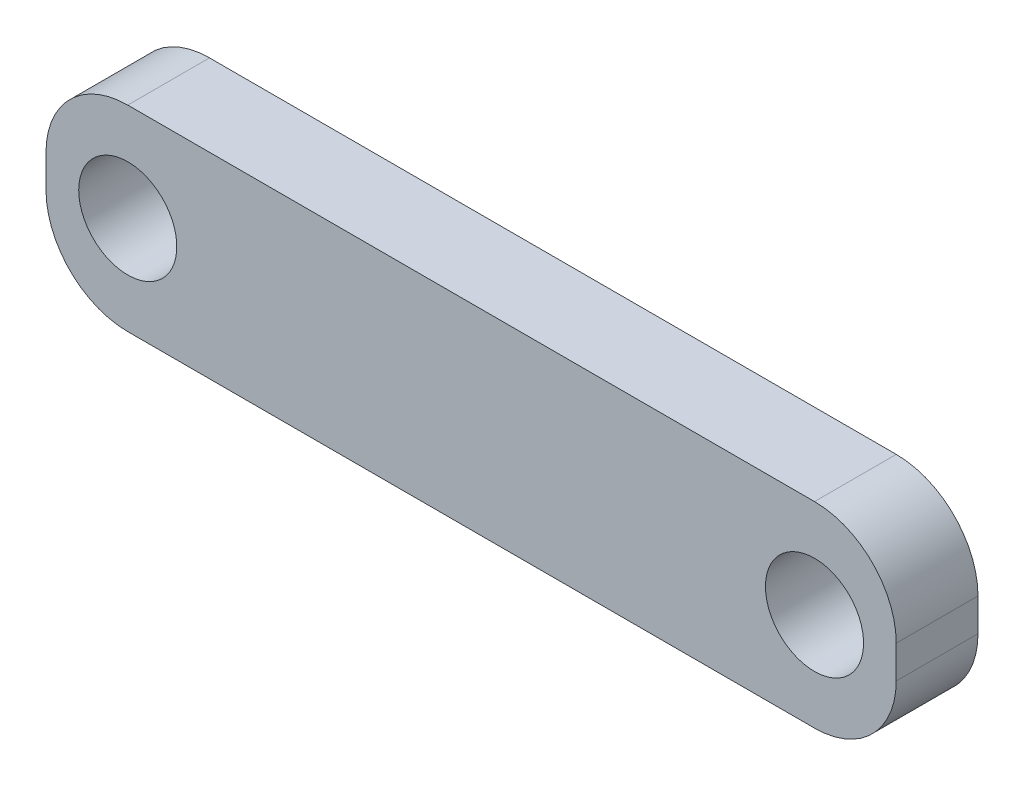
ISO-10303-21;
HEADER;
FILE_DESCRIPTION(('STEP AP214'),'2;1');
FILE_NAME('part.step','',(''),(''),'','','');
FILE_SCHEMA(('AUTOMOTIVE_DESIGN { 1 0 10303 214 1 1 1 1 }'));
ENDSEC;
DATA;
#1=APPLICATION_CONTEXT('core data for automotive mechanical design processes');
#2=APPLICATION_PROTOCOL_DEFINITION('international standard','automotive_design',2000,#1);
#3=PRODUCT_CONTEXT('',#1,'mechanical');
#4=PRODUCT('Part','Part','',(#3));
#5=PRODUCT_RELATED_PRODUCT_CATEGORY('part','',(#4));
#6=PRODUCT_DEFINITION_FORMATION('','',#4);
#7=PRODUCT_DEFINITION_CONTEXT('part definition',#1,'design');
#8=PRODUCT_DEFINITION('design','',#6,#7);
#9=PRODUCT_DEFINITION_SHAPE('','',#8);
#10=(LENGTH_UNIT() NAMED_UNIT(*) SI_UNIT(.MILLI.,.METRE.));
#11=(NAMED_UNIT(*) PLANE_ANGLE_UNIT() SI_UNIT($,.RADIAN.));
#12=(NAMED_UNIT(*) SI_UNIT($,.STERADIAN.) SOLID_ANGLE_UNIT());
#13=UNCERTAINTY_MEASURE_WITH_UNIT(LENGTH_MEASURE(1.E-05),#10,'distance_accuracy_value','');
#14=(GEOMETRIC_REPRESENTATION_CONTEXT(3) GLOBAL_UNCERTAINTY_ASSIGNED_CONTEXT((#13)) GLOBAL_UNIT_ASSIGNED_CONTEXT((#10,
#11,#12)) REPRESENTATION_CONTEXT('',''));
#15=CARTESIAN_POINT('',(0.,0.,0.));
#16=DIRECTION('',(0.,0.,1.));
#17=DIRECTION('',(1.,0.,0.));
#18=AXIS2_PLACEMENT_3D('',#15,#16,#17);
#19=CARTESIAN_POINT('',(-21.,1.,0.));
#20=DIRECTION('',(0.,0.,1.));
#21=DIRECTION('',(1.,0.,0.));
#22=AXIS2_PLACEMENT_3D('',#19,#20,#21);
#23=CYLINDRICAL_SURFACE('',#22,5.);
#24=CARTESIAN_POINT('',(-21.,1.,5.));
#25=DIRECTION('',(0.,0.,1.));
#26=DIRECTION('',(1.,0.,0.));
#27=AXIS2_PLACEMENT_3D('',#24,#25,#26);
#28=CIRCLE('',#27,5.);
#29=CARTESIAN_POINT('',(-21.,6.,5.));
#30=VERTEX_POINT('',#29);
#31=CARTESIAN_POINT('',(-26.,1.,5.));
#32=VERTEX_POINT('',#31);
#33=EDGE_CURVE('E131',#30,#32,#28,.T.);
#34=ORIENTED_EDGE('',*,*,#33,.F.);
#35=DIRECTION('',(0.,0.,1.));
#36=VECTOR('',#35,1.);
#37=CARTESIAN_POINT('',(-21.,6.,0.));
#38=LINE('',#37,#36);
#39=CARTESIAN_POINT('',(-21.,6.,0.));
#40=VERTEX_POINT('',#39);
#41=EDGE_CURVE('E11',#40,#30,#38,.T.);
#42=ORIENTED_EDGE('',*,*,#41,.F.);
#43=CARTESIAN_POINT('',(-21.,1.,0.));
#44=DIRECTION('',(0.,0.,1.));
#45=DIRECTION('',(1.,0.,0.));
#46=AXIS2_PLACEMENT_3D('',#43,#44,#45);
#47=CIRCLE('',#46,5.);
#48=CARTESIAN_POINT('',(-26.,1.,0.));
#49=VERTEX_POINT('',#48);
#50=EDGE_CURVE('E152',#40,#49,#47,.T.);
#51=ORIENTED_EDGE('',*,*,#50,.T.);
#52=DIRECTION('',(0.,0.,1.));
#53=VECTOR('',#52,1.);
#54=CARTESIAN_POINT('',(-26.,1.,0.));
#55=LINE('',#54,#53);
#56=EDGE_CURVE('E37',#49,#32,#55,.T.);
#57=ORIENTED_EDGE('',*,*,#56,.T.);
#58=EDGE_LOOP('',(#34,#42,#51,#57));
#59=FACE_BOUND('',#58,.T.);
#60=ADVANCED_FACE('F34',(#59),#23,.T.);
#61=CARTESIAN_POINT('',(21.,6.00000000000001,0.));
#62=DIRECTION('',(0.,1.,0.));
#63=DIRECTION('',(-1.,0.,0.));
#64=AXIS2_PLACEMENT_3D('',#61,#62,#63);
#65=PLANE('',#64);
#66=DIRECTION('',(-1.,0.,0.));
#67=VECTOR('',#66,1.);
#68=CARTESIAN_POINT('',(21.,6.00000000000001,5.));
#69=LINE('',#68,#67);
#70=CARTESIAN_POINT('',(21.,6.,5.));
#71=VERTEX_POINT('',#70);
#72=EDGE_CURVE('E150',#71,#30,#69,.T.);
#73=ORIENTED_EDGE('',*,*,#72,.F.);
#74=DIRECTION('',(0.,0.,1.));
#75=VECTOR('',#74,1.);
#76=CARTESIAN_POINT('',(21.,6.,0.));
#77=LINE('',#76,#75);
#78=CARTESIAN_POINT('',(21.,6.,0.));
#79=VERTEX_POINT('',#78);
#80=EDGE_CURVE('E43',#79,#71,#77,.T.);
#81=ORIENTED_EDGE('',*,*,#80,.F.);
#82=DIRECTION('',(-1.,0.,0.));
#83=VECTOR('',#82,1.);
#84=CARTESIAN_POINT('',(21.,6.00000000000001,0.));
#85=LINE('',#84,#83);
#86=EDGE_CURVE('E121',#79,#40,#85,.T.);
#87=ORIENTED_EDGE('',*,*,#86,.T.);
#88=ORIENTED_EDGE('',*,*,#41,.T.);
#89=EDGE_LOOP('',(#73,#81,#87,#88));
#90=FACE_BOUND('',#89,.T.);
#91=ADVANCED_FACE('F164',(#90),#65,.T.);
#92=CARTESIAN_POINT('',(21.,1.,0.));
#93=DIRECTION('',(0.,0.,1.));
#94=DIRECTION('',(1.,0.,0.));
#95=AXIS2_PLACEMENT_3D('',#92,#93,#94);
#96=CYLINDRICAL_SURFACE('',#95,5.);
#97=CARTESIAN_POINT('',(21.,1.,5.));
#98=DIRECTION('',(0.,0.,1.));
#99=DIRECTION('',(1.,0.,0.));
#100=AXIS2_PLACEMENT_3D('',#97,#98,#99);
#101=CIRCLE('',#100,5.);
#102=CARTESIAN_POINT('',(26.,1.,5.));
#103=VERTEX_POINT('',#102);
#104=EDGE_CURVE('E108',#103,#71,#101,.T.);
#105=ORIENTED_EDGE('',*,*,#104,.F.);
#106=DIRECTION('',(0.,0.,1.));
#107=VECTOR('',#106,1.);
#108=CARTESIAN_POINT('',(26.,1.,0.));
#109=LINE('',#108,#107);
#110=CARTESIAN_POINT('',(26.,1.,0.));
#111=VERTEX_POINT('',#110);
#112=EDGE_CURVE('E103',#111,#103,#109,.T.);
#113=ORIENTED_EDGE('',*,*,#112,.F.);
#114=CARTESIAN_POINT('',(21.,1.,0.));
#115=DIRECTION('',(0.,0.,1.));
#116=DIRECTION('',(1.,0.,0.));
#117=AXIS2_PLACEMENT_3D('',#114,#115,#116);
#118=CIRCLE('',#117,5.);
#119=EDGE_CURVE('E106',#111,#79,#118,.T.);
#120=ORIENTED_EDGE('',*,*,#119,.T.);
#121=ORIENTED_EDGE('',*,*,#80,.T.);
#122=EDGE_LOOP('',(#105,#113,#120,#121));
#123=FACE_BOUND('',#122,.T.);
#124=ADVANCED_FACE('F105',(#123),#96,.T.);
#125=CARTESIAN_POINT('',(26.,-1.,0.));
#126=DIRECTION('',(1.,0.,0.));
#127=DIRECTION('',(0.,0.,-1.));
#128=AXIS2_PLACEMENT_3D('',#125,#126,#127);
#129=PLANE('',#128);
#130=DIRECTION('',(0.,1.,0.));
#131=VECTOR('',#130,1.);
#132=CARTESIAN_POINT('',(26.,-1.,5.));
#133=LINE('',#132,#131);
#134=CARTESIAN_POINT('',(26.,-1.,5.));
#135=VERTEX_POINT('',#134);
#136=EDGE_CURVE('E147',#135,#103,#133,.T.);
#137=ORIENTED_EDGE('',*,*,#136,.F.);
#138=DIRECTION('',(0.,0.,1.));
#139=VECTOR('',#138,1.);
#140=CARTESIAN_POINT('',(26.,-1.,0.));
#141=LINE('',#140,#139);
#142=CARTESIAN_POINT('',(26.,-1.,0.));
#143=VERTEX_POINT('',#142);
#144=EDGE_CURVE('E113',#143,#135,#141,.T.);
#145=ORIENTED_EDGE('',*,*,#144,.F.);
#146=DIRECTION('',(0.,1.,0.));
#147=VECTOR('',#146,1.);
#148=CARTESIAN_POINT('',(26.,-1.,0.));
#149=LINE('',#148,#147);
#150=EDGE_CURVE('E119',#143,#111,#149,.T.);
#151=ORIENTED_EDGE('',*,*,#150,.T.);
#152=ORIENTED_EDGE('',*,*,#112,.T.);
#153=EDGE_LOOP('',(#137,#145,#151,#152));
#154=FACE_BOUND('',#153,.T.);
#155=ADVANCED_FACE('F123',(#154),#129,.T.);
#156=CARTESIAN_POINT('',(21.,-1.,0.));
#157=DIRECTION('',(0.,0.,1.));
#158=DIRECTION('',(1.,0.,0.));
#159=AXIS2_PLACEMENT_3D('',#156,#157,#158);
#160=CYLINDRICAL_SURFACE('',#159,5.);
#161=CARTESIAN_POINT('',(21.,-1.,5.));
#162=DIRECTION('',(0.,0.,1.));
#163=DIRECTION('',(1.,0.,0.));
#164=AXIS2_PLACEMENT_3D('',#161,#162,#163);
#165=CIRCLE('',#164,5.);
#166=CARTESIAN_POINT('',(21.,-6.,5.));
#167=VERTEX_POINT('',#166);
#168=EDGE_CURVE('E144',#167,#135,#165,.T.);
#169=ORIENTED_EDGE('',*,*,#168,.F.);
#170=DIRECTION('',(0.,0.,1.));
#171=VECTOR('',#170,1.);
#172=CARTESIAN_POINT('',(21.,-6.,0.));
#173=LINE('',#172,#171);
#174=CARTESIAN_POINT('',(21.,-6.,0.));
#175=VERTEX_POINT('',#174);
#176=EDGE_CURVE('E156',#175,#167,#173,.T.);
#177=ORIENTED_EDGE('',*,*,#176,.F.);
#178=CARTESIAN_POINT('',(21.,-1.,0.));
#179=DIRECTION('',(0.,0.,1.));
#180=DIRECTION('',(1.,0.,0.));
#181=AXIS2_PLACEMENT_3D('',#178,#179,#180);
#182=CIRCLE('',#181,5.);
#183=EDGE_CURVE('E124',#175,#143,#182,.T.);
#184=ORIENTED_EDGE('',*,*,#183,.T.);
#185=ORIENTED_EDGE('',*,*,#144,.T.);
#186=EDGE_LOOP('',(#169,#177,#184,#185));
#187=FACE_BOUND('',#186,.T.);
#188=ADVANCED_FACE('F177',(#187),#160,.T.);
#189=CARTESIAN_POINT('',(-21.,-6.,0.));
#190=DIRECTION('',(0.,-1.,0.));
#191=DIRECTION('',(1.,0.,0.));
#192=AXIS2_PLACEMENT_3D('',#189,#190,#191);
#193=PLANE('',#192);
#194=DIRECTION('',(1.,0.,0.));
#195=VECTOR('',#194,1.);
#196=CARTESIAN_POINT('',(-21.,-6.,5.));
#197=LINE('',#196,#195);
#198=CARTESIAN_POINT('',(-21.,-6.,5.));
#199=VERTEX_POINT('',#198);
#200=EDGE_CURVE('E141',#199,#167,#197,.T.);
#201=ORIENTED_EDGE('',*,*,#200,.F.);
#202=DIRECTION('',(0.,0.,1.));
#203=VECTOR('',#202,1.);
#204=CARTESIAN_POINT('',(-21.,-6.,0.));
#205=LINE('',#204,#203);
#206=CARTESIAN_POINT('',(-21.,-6.,0.));
#207=VERTEX_POINT('',#206);
#208=EDGE_CURVE('E158',#207,#199,#205,.T.);
#209=ORIENTED_EDGE('',*,*,#208,.F.);
#210=DIRECTION('',(1.,0.,0.));
#211=VECTOR('',#210,1.);
#212=CARTESIAN_POINT('',(-21.,-6.,0.));
#213=LINE('',#212,#211);
#214=EDGE_CURVE('E126',#207,#175,#213,.T.);
#215=ORIENTED_EDGE('',*,*,#214,.T.);
#216=ORIENTED_EDGE('',*,*,#176,.T.);
#217=EDGE_LOOP('',(#201,#209,#215,#216));
#218=FACE_BOUND('',#217,.T.);
#219=ADVANCED_FACE('F180',(#218),#193,.T.);
#220=CARTESIAN_POINT('',(-21.,-1.,0.));
#221=DIRECTION('',(0.,0.,1.));
#222=DIRECTION('',(1.,0.,0.));
#223=AXIS2_PLACEMENT_3D('',#220,#221,#222);
#224=CYLINDRICAL_SURFACE('',#223,5.);
#225=CARTESIAN_POINT('',(-21.,-1.,5.));
#226=DIRECTION('',(0.,0.,1.));
#227=DIRECTION('',(1.,0.,0.));
#228=AXIS2_PLACEMENT_3D('',#225,#226,#227);
#229=CIRCLE('',#228,5.);
#230=CARTESIAN_POINT('',(-26.,-1.,5.));
#231=VERTEX_POINT('',#230);
#232=EDGE_CURVE('E138',#231,#199,#229,.T.);
#233=ORIENTED_EDGE('',*,*,#232,.F.);
#234=DIRECTION('',(0.,0.,1.));
#235=VECTOR('',#234,1.);
#236=CARTESIAN_POINT('',(-26.,-1.,0.));
#237=LINE('',#236,#235);
#238=CARTESIAN_POINT('',(-26.,-1.,0.));
#239=VERTEX_POINT('',#238);
#240=EDGE_CURVE('E159',#239,#231,#237,.T.);
#241=ORIENTED_EDGE('',*,*,#240,.F.);
#242=CARTESIAN_POINT('',(-21.,-1.,0.));
#243=DIRECTION('',(0.,0.,1.));
#244=DIRECTION('',(1.,0.,0.));
#245=AXIS2_PLACEMENT_3D('',#242,#243,#244);
#246=CIRCLE('',#245,5.);
#247=EDGE_CURVE('E226',#239,#207,#246,.T.);
#248=ORIENTED_EDGE('',*,*,#247,.T.);
#249=ORIENTED_EDGE('',*,*,#208,.T.);
#250=EDGE_LOOP('',(#233,#241,#248,#249));
#251=FACE_BOUND('',#250,.T.);
#252=ADVANCED_FACE('F184',(#251),#224,.T.);
#253=CARTESIAN_POINT('',(-26.,1.,0.));
#254=DIRECTION('',(-1.,0.,0.));
#255=DIRECTION('',(0.,0.,1.));
#256=AXIS2_PLACEMENT_3D('',#253,#254,#255);
#257=PLANE('',#256);
#258=DIRECTION('',(0.,-1.,0.));
#259=VECTOR('',#258,1.);
#260=CARTESIAN_POINT('',(-26.,1.,5.));
#261=LINE('',#260,#259);
#262=EDGE_CURVE('E134',#32,#231,#261,.T.);
#263=ORIENTED_EDGE('',*,*,#262,.F.);
#264=ORIENTED_EDGE('',*,*,#56,.F.);
#265=DIRECTION('',(0.,-1.,0.));
#266=VECTOR('',#265,1.);
#267=CARTESIAN_POINT('',(-26.,1.,0.));
#268=LINE('',#267,#266);
#269=EDGE_CURVE('E224',#49,#239,#268,.T.);
#270=ORIENTED_EDGE('',*,*,#269,.T.);
#271=ORIENTED_EDGE('',*,*,#240,.T.);
#272=EDGE_LOOP('',(#263,#264,#270,#271));
#273=FACE_BOUND('',#272,.T.);
#274=ADVANCED_FACE('F161',(#273),#257,.T.);
#275=CARTESIAN_POINT('',(-21.,1.,0.));
#276=DIRECTION('',(0.,0.,1.));
#277=DIRECTION('',(1.,0.,0.));
#278=AXIS2_PLACEMENT_3D('',#275,#276,#277);
#279=PLANE('',#278);
#280=CARTESIAN_POINT('',(-21.,0.,0.));
#281=DIRECTION('',(0.,0.,1.));
#282=DIRECTION('',(-1.,0.,0.));
#283=AXIS2_PLACEMENT_3D('',#280,#281,#282);
#284=CIRCLE('',#283,3.);
#285=CARTESIAN_POINT('',(-24.,0.,0.));
#286=VERTEX_POINT('',#285);
#287=EDGE_CURVE('E211',#286,#286,#284,.T.);
#288=ORIENTED_EDGE('',*,*,#287,.T.);
#289=EDGE_LOOP('',(#288));
#290=FACE_BOUND('',#289,.T.);
#291=CARTESIAN_POINT('',(21.,0.,0.));
#292=DIRECTION('',(0.,0.,1.));
#293=DIRECTION('',(-1.,0.,0.));
#294=AXIS2_PLACEMENT_3D('',#291,#292,#293);
#295=CIRCLE('',#294,3.);
#296=CARTESIAN_POINT('',(18.,0.,0.));
#297=VERTEX_POINT('',#296);
#298=EDGE_CURVE('E135',#297,#297,#295,.T.);
#299=ORIENTED_EDGE('',*,*,#298,.T.);
#300=EDGE_LOOP('',(#299));
#301=FACE_BOUND('',#300,.T.);
#302=ORIENTED_EDGE('',*,*,#50,.F.);
#303=ORIENTED_EDGE('',*,*,#86,.F.);
#304=ORIENTED_EDGE('',*,*,#119,.F.);
#305=ORIENTED_EDGE('',*,*,#150,.F.);
#306=ORIENTED_EDGE('',*,*,#183,.F.);
#307=ORIENTED_EDGE('',*,*,#214,.F.);
#308=ORIENTED_EDGE('',*,*,#247,.F.);
#309=ORIENTED_EDGE('',*,*,#269,.F.);
#310=EDGE_LOOP('',(#302,#303,#304,#305,#306,#307,#308,#309));
#311=FACE_BOUND('',#310,.T.);
#312=ADVANCED_FACE('F117',(#290,#301,#311),#279,.F.);
#313=CARTESIAN_POINT('',(-21.,1.,5.));
#314=DIRECTION('',(0.,0.,1.));
#315=DIRECTION('',(1.,0.,0.));
#316=AXIS2_PLACEMENT_3D('',#313,#314,#315);
#317=PLANE('',#316);
#318=CARTESIAN_POINT('',(-21.,0.,5.));
#319=DIRECTION('',(0.,0.,1.));
#320=DIRECTION('',(-1.,0.,0.));
#321=AXIS2_PLACEMENT_3D('',#318,#319,#320);
#322=CIRCLE('',#321,3.);
#323=CARTESIAN_POINT('',(-24.,0.,5.));
#324=VERTEX_POINT('',#323);
#325=EDGE_CURVE('E214',#324,#324,#322,.T.);
#326=ORIENTED_EDGE('',*,*,#325,.F.);
#327=EDGE_LOOP('',(#326));
#328=FACE_BOUND('',#327,.T.);
#329=CARTESIAN_POINT('',(21.,0.,5.));
#330=DIRECTION('',(0.,0.,1.));
#331=DIRECTION('',(-1.,0.,0.));
#332=AXIS2_PLACEMENT_3D('',#329,#330,#331);
#333=CIRCLE('',#332,3.);
#334=CARTESIAN_POINT('',(18.,0.,5.));
#335=VERTEX_POINT('',#334);
#336=EDGE_CURVE('E216',#335,#335,#333,.T.);
#337=ORIENTED_EDGE('',*,*,#336,.F.);
#338=EDGE_LOOP('',(#337));
#339=FACE_BOUND('',#338,.T.);
#340=ORIENTED_EDGE('',*,*,#33,.T.);
#341=ORIENTED_EDGE('',*,*,#262,.T.);
#342=ORIENTED_EDGE('',*,*,#232,.T.);
#343=ORIENTED_EDGE('',*,*,#200,.T.);
#344=ORIENTED_EDGE('',*,*,#168,.T.);
#345=ORIENTED_EDGE('',*,*,#136,.T.);
#346=ORIENTED_EDGE('',*,*,#104,.T.);
#347=ORIENTED_EDGE('',*,*,#72,.T.);
#348=EDGE_LOOP('',(#340,#341,#342,#343,#344,#345,#346,#347));
#349=FACE_BOUND('',#348,.T.);
#350=ADVANCED_FACE('F163',(#328,#339,#349),#317,.T.);
#351=CARTESIAN_POINT('',(21.,0.,0.));
#352=DIRECTION('',(0.,0.,1.));
#353=DIRECTION('',(1.,0.,0.));
#354=AXIS2_PLACEMENT_3D('',#351,#352,#353);
#355=CYLINDRICAL_SURFACE('',#354,3.);
#356=ORIENTED_EDGE('',*,*,#298,.F.);
#357=EDGE_LOOP('',(#356));
#358=FACE_BOUND('',#357,.T.);
#359=ORIENTED_EDGE('',*,*,#336,.T.);
#360=EDGE_LOOP('',(#359));
#361=FACE_BOUND('',#360,.T.);
#362=ADVANCED_FACE('F196',(#358,#361),#355,.F.);
#363=CARTESIAN_POINT('',(-21.,0.,0.));
#364=DIRECTION('',(0.,0.,1.));
#365=DIRECTION('',(1.,0.,0.));
#366=AXIS2_PLACEMENT_3D('',#363,#364,#365);
#367=CYLINDRICAL_SURFACE('',#366,3.);
#368=ORIENTED_EDGE('',*,*,#287,.F.);
#369=EDGE_LOOP('',(#368));
#370=FACE_BOUND('',#369,.T.);
#371=ORIENTED_EDGE('',*,*,#325,.T.);
#372=EDGE_LOOP('',(#371));
#373=FACE_BOUND('',#372,.T.);
#374=ADVANCED_FACE('F203',(#370,#373),#367,.F.);
#375=CLOSED_SHELL('',(#60,#91,#124,#155,#188,#219,#252,#274,#312,#350,#362,#374));
#376=MANIFOLD_SOLID_BREP('B2',#375);
#377=ADVANCED_BREP_SHAPE_REPRESENTATION('',(#18,#376),#14);
#378=SHAPE_DEFINITION_REPRESENTATION(#9,#377);
ENDSEC;
END-ISO-10303-21;
